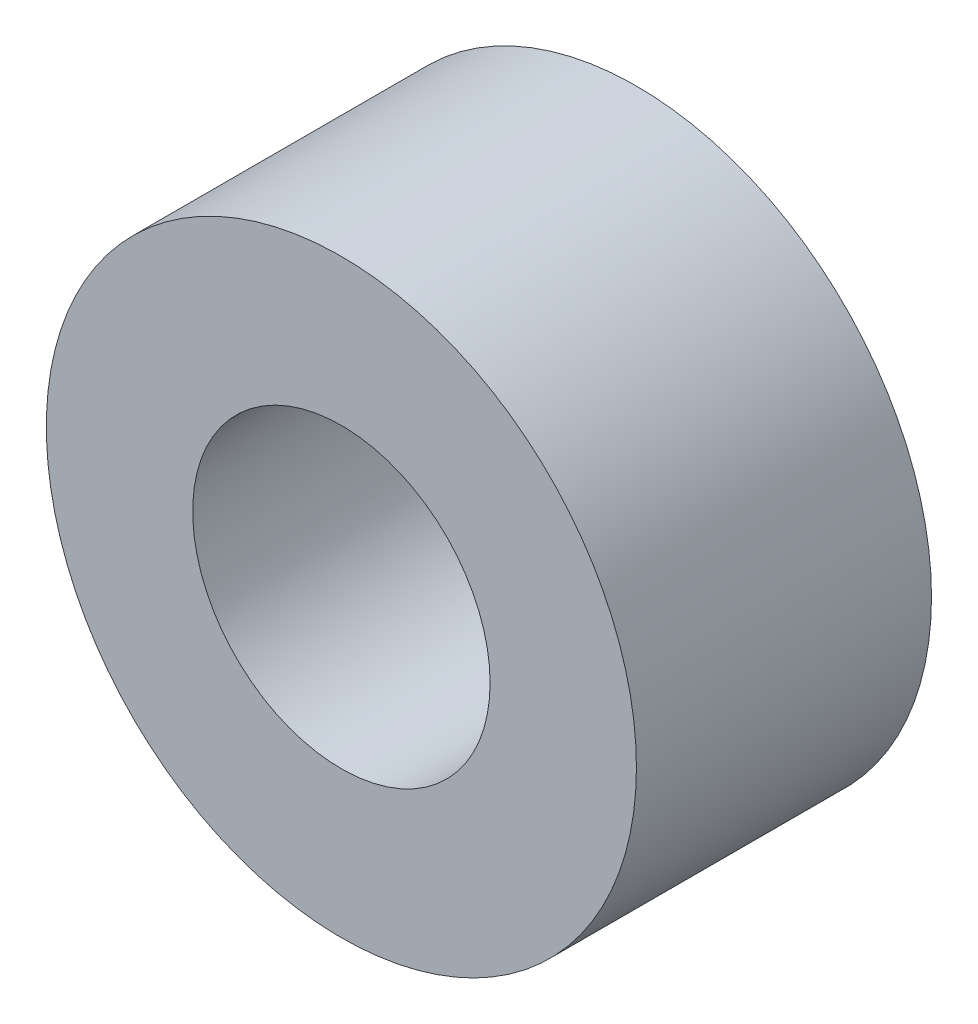
ISO-10303-21;
HEADER;
FILE_DESCRIPTION(('STEP AP214'),'2;1');
FILE_NAME('part.step','',(''),(''),'','','');
FILE_SCHEMA(('AUTOMOTIVE_DESIGN { 1 0 10303 214 1 1 1 1 }'));
ENDSEC;
DATA;
#1=APPLICATION_CONTEXT('core data for automotive mechanical design processes');
#2=APPLICATION_PROTOCOL_DEFINITION('international standard','automotive_design',2000,#1);
#3=PRODUCT_CONTEXT('',#1,'mechanical');
#4=PRODUCT('Part','Part','',(#3));
#5=PRODUCT_RELATED_PRODUCT_CATEGORY('part','',(#4));
#6=PRODUCT_DEFINITION_FORMATION('','',#4);
#7=PRODUCT_DEFINITION_CONTEXT('part definition',#1,'design');
#8=PRODUCT_DEFINITION('design','',#6,#7);
#9=PRODUCT_DEFINITION_SHAPE('','',#8);
#10=(LENGTH_UNIT() NAMED_UNIT(*) SI_UNIT(.MILLI.,.METRE.));
#11=(NAMED_UNIT(*) PLANE_ANGLE_UNIT() SI_UNIT($,.RADIAN.));
#12=(NAMED_UNIT(*) SI_UNIT($,.STERADIAN.) SOLID_ANGLE_UNIT());
#13=UNCERTAINTY_MEASURE_WITH_UNIT(LENGTH_MEASURE(1.E-05),#10,'distance_accuracy_value','');
#14=(GEOMETRIC_REPRESENTATION_CONTEXT(3) GLOBAL_UNCERTAINTY_ASSIGNED_CONTEXT((#13)) GLOBAL_UNIT_ASSIGNED_CONTEXT((#10,
#11,#12)) REPRESENTATION_CONTEXT('',''));
#15=CARTESIAN_POINT('',(0.,0.,0.));
#16=DIRECTION('',(0.,0.,1.));
#17=DIRECTION('',(1.,0.,0.));
#18=AXIS2_PLACEMENT_3D('',#15,#16,#17);
#19=CARTESIAN_POINT('',(0.,0.,3.175));
#20=DIRECTION('',(0.,0.,1.));
#21=DIRECTION('',(1.,0.,0.));
#22=AXIS2_PLACEMENT_3D('',#19,#20,#21);
#23=PLANE('',#22);
#24=CARTESIAN_POINT('',(0.,0.,3.175));
#25=DIRECTION('',(0.,0.,1.));
#26=DIRECTION('',(1.,0.,0.));
#27=AXIS2_PLACEMENT_3D('',#24,#25,#26);
#28=CIRCLE('',#27,6.35);
#29=CARTESIAN_POINT('',(6.35,0.,3.175));
#30=VERTEX_POINT('',#29);
#31=EDGE_CURVE('E10',#30,#30,#28,.T.);
#32=ORIENTED_EDGE('',*,*,#31,.T.);
#33=EDGE_LOOP('',(#32));
#34=FACE_BOUND('',#33,.T.);
#35=CARTESIAN_POINT('',(0.,0.,3.175));
#36=DIRECTION('',(0.,0.,1.));
#37=DIRECTION('',(1.,0.,0.));
#38=AXIS2_PLACEMENT_3D('',#35,#36,#37);
#39=CIRCLE('',#38,3.2004);
#40=CARTESIAN_POINT('',(3.2004,0.,3.175));
#41=VERTEX_POINT('',#40);
#42=EDGE_CURVE('E41',#41,#41,#39,.T.);
#43=ORIENTED_EDGE('',*,*,#42,.F.);
#44=EDGE_LOOP('',(#43));
#45=FACE_BOUND('',#44,.T.);
#46=ADVANCED_FACE('F30',(#34,#45),#23,.T.);
#47=CARTESIAN_POINT('',(0.,0.,-3.175));
#48=DIRECTION('',(0.,0.,1.));
#49=DIRECTION('',(1.,0.,0.));
#50=AXIS2_PLACEMENT_3D('',#47,#48,#49);
#51=PLANE('',#50);
#52=CARTESIAN_POINT('',(0.,0.,-3.175));
#53=DIRECTION('',(0.,0.,1.));
#54=DIRECTION('',(1.,0.,0.));
#55=AXIS2_PLACEMENT_3D('',#52,#53,#54);
#56=CIRCLE('',#55,6.35);
#57=CARTESIAN_POINT('',(6.35,0.,-3.175));
#58=VERTEX_POINT('',#57);
#59=EDGE_CURVE('E34',#58,#58,#56,.T.);
#60=ORIENTED_EDGE('',*,*,#59,.F.);
#61=EDGE_LOOP('',(#60));
#62=FACE_BOUND('',#61,.T.);
#63=CARTESIAN_POINT('',(0.,0.,-3.175));
#64=DIRECTION('',(0.,0.,1.));
#65=DIRECTION('',(1.,0.,0.));
#66=AXIS2_PLACEMENT_3D('',#63,#64,#65);
#67=CIRCLE('',#66,3.2004);
#68=CARTESIAN_POINT('',(3.2004,0.,-3.175));
#69=VERTEX_POINT('',#68);
#70=EDGE_CURVE('E43',#69,#69,#67,.T.);
#71=ORIENTED_EDGE('',*,*,#70,.T.);
#72=EDGE_LOOP('',(#71));
#73=FACE_BOUND('',#72,.T.);
#74=ADVANCED_FACE('F53',(#62,#73),#51,.F.);
#75=CARTESIAN_POINT('',(0.,0.,3.175));
#76=DIRECTION('',(0.,0.,-1.));
#77=DIRECTION('',(-1.,0.,0.));
#78=AXIS2_PLACEMENT_3D('',#75,#76,#77);
#79=CYLINDRICAL_SURFACE('',#78,6.35);
#80=ORIENTED_EDGE('',*,*,#31,.F.);
#81=EDGE_LOOP('',(#80));
#82=FACE_BOUND('',#81,.T.);
#83=ORIENTED_EDGE('',*,*,#59,.T.);
#84=EDGE_LOOP('',(#83));
#85=FACE_BOUND('',#84,.T.);
#86=ADVANCED_FACE('F32',(#82,#85),#79,.T.);
#87=CARTESIAN_POINT('',(0.,0.,3.175));
#88=DIRECTION('',(0.,0.,-1.));
#89=DIRECTION('',(-1.,0.,0.));
#90=AXIS2_PLACEMENT_3D('',#87,#88,#89);
#91=CYLINDRICAL_SURFACE('',#90,3.2004);
#92=ORIENTED_EDGE('',*,*,#42,.T.);
#93=EDGE_LOOP('',(#92));
#94=FACE_BOUND('',#93,.T.);
#95=ORIENTED_EDGE('',*,*,#70,.F.);
#96=EDGE_LOOP('',(#95));
#97=FACE_BOUND('',#96,.T.);
#98=ADVANCED_FACE('F49',(#94,#97),#91,.F.);
#99=CLOSED_SHELL('',(#46,#74,#86,#98));
#100=MANIFOLD_SOLID_BREP('B2',#99);
#101=ADVANCED_BREP_SHAPE_REPRESENTATION('',(#18,#100),#14);
#102=SHAPE_DEFINITION_REPRESENTATION(#9,#101);
ENDSEC;
END-ISO-10303-21;
